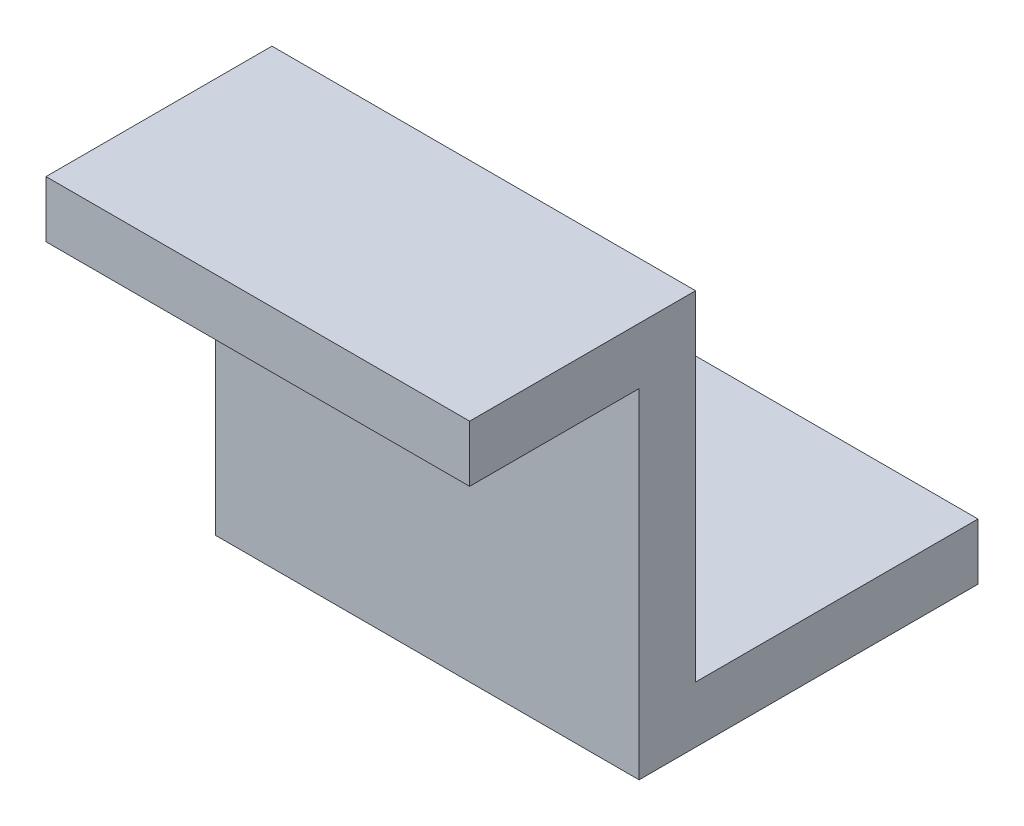
ISO-10303-21;
HEADER;
FILE_DESCRIPTION(('STEP AP214'),'2;1');
FILE_NAME('part.step','',(''),(''),'','','');
FILE_SCHEMA(('AUTOMOTIVE_DESIGN { 1 0 10303 214 1 1 1 1 }'));
ENDSEC;
DATA;
#1=APPLICATION_CONTEXT('core data for automotive mechanical design processes');
#2=APPLICATION_PROTOCOL_DEFINITION('international standard','automotive_design',2000,#1);
#3=PRODUCT_CONTEXT('',#1,'mechanical');
#4=PRODUCT('Part','Part','',(#3));
#5=PRODUCT_RELATED_PRODUCT_CATEGORY('part','',(#4));
#6=PRODUCT_DEFINITION_FORMATION('','',#4);
#7=PRODUCT_DEFINITION_CONTEXT('part definition',#1,'design');
#8=PRODUCT_DEFINITION('design','',#6,#7);
#9=PRODUCT_DEFINITION_SHAPE('','',#8);
#10=(LENGTH_UNIT() NAMED_UNIT(*) SI_UNIT(.MILLI.,.METRE.));
#11=(NAMED_UNIT(*) PLANE_ANGLE_UNIT() SI_UNIT($,.RADIAN.));
#12=(NAMED_UNIT(*) SI_UNIT($,.STERADIAN.) SOLID_ANGLE_UNIT());
#13=UNCERTAINTY_MEASURE_WITH_UNIT(LENGTH_MEASURE(1.E-05),#10,'distance_accuracy_value','');
#14=(GEOMETRIC_REPRESENTATION_CONTEXT(3) GLOBAL_UNCERTAINTY_ASSIGNED_CONTEXT((#13)) GLOBAL_UNIT_ASSIGNED_CONTEXT((#10,
#11,#12)) REPRESENTATION_CONTEXT('',''));
#15=CARTESIAN_POINT('',(0.,0.,0.));
#16=DIRECTION('',(0.,0.,1.));
#17=DIRECTION('',(1.,0.,0.));
#18=AXIS2_PLACEMENT_3D('',#15,#16,#17);
#19=CARTESIAN_POINT('',(-15.,-2.,0.));
#20=DIRECTION('',(0.,0.,1.));
#21=DIRECTION('',(1.,0.,0.));
#22=AXIS2_PLACEMENT_3D('',#19,#20,#21);
#23=PLANE('',#22);
#24=DIRECTION('',(0.,-1.,0.));
#25=VECTOR('',#24,1.);
#26=CARTESIAN_POINT('',(0.,-2.,0.));
#27=LINE('',#26,#25);
#28=CARTESIAN_POINT('',(0.,0.,0.));
#29=VERTEX_POINT('',#28);
#30=CARTESIAN_POINT('',(0.,-2.,0.));
#31=VERTEX_POINT('',#30);
#32=EDGE_CURVE('E130',#29,#31,#27,.T.);
#33=ORIENTED_EDGE('',*,*,#32,.F.);
#34=DIRECTION('',(1.,0.,0.));
#35=VECTOR('',#34,1.);
#36=CARTESIAN_POINT('',(-15.,0.,0.));
#37=LINE('',#36,#35);
#38=CARTESIAN_POINT('',(-15.,0.,0.));
#39=VERTEX_POINT('',#38);
#40=EDGE_CURVE('E11',#39,#29,#37,.T.);
#41=ORIENTED_EDGE('',*,*,#40,.F.);
#42=DIRECTION('',(0.,-1.,0.));
#43=VECTOR('',#42,1.);
#44=CARTESIAN_POINT('',(-15.,-2.,0.));
#45=LINE('',#44,#43);
#46=CARTESIAN_POINT('',(-15.,-2.,0.));
#47=VERTEX_POINT('',#46);
#48=EDGE_CURVE('E151',#39,#47,#45,.T.);
#49=ORIENTED_EDGE('',*,*,#48,.T.);
#50=DIRECTION('',(1.,0.,0.));
#51=VECTOR('',#50,1.);
#52=CARTESIAN_POINT('',(-15.,-2.,0.));
#53=LINE('',#52,#51);
#54=EDGE_CURVE('E36',#47,#31,#53,.T.);
#55=ORIENTED_EDGE('',*,*,#54,.T.);
#56=EDGE_LOOP('',(#33,#41,#49,#55));
#57=FACE_BOUND('',#56,.T.);
#58=ADVANCED_FACE('F33',(#57),#23,.T.);
#59=CARTESIAN_POINT('',(-15.,0.,0.));
#60=DIRECTION('',(0.,1.,0.));
#61=DIRECTION('',(0.,0.,1.));
#62=AXIS2_PLACEMENT_3D('',#59,#60,#61);
#63=PLANE('',#62);
#64=DIRECTION('',(0.,0.,1.));
#65=VECTOR('',#64,1.);
#66=CARTESIAN_POINT('',(0.,0.,0.));
#67=LINE('',#66,#65);
#68=CARTESIAN_POINT('',(0.,0.,-8.));
#69=VERTEX_POINT('',#68);
#70=EDGE_CURVE('E149',#69,#29,#67,.T.);
#71=ORIENTED_EDGE('',*,*,#70,.F.);
#72=DIRECTION('',(1.,0.,0.));
#73=VECTOR('',#72,1.);
#74=CARTESIAN_POINT('',(-15.,0.,-8.));
#75=LINE('',#74,#73);
#76=CARTESIAN_POINT('',(-15.,0.,-8.));
#77=VERTEX_POINT('',#76);
#78=EDGE_CURVE('E42',#77,#69,#75,.T.);
#79=ORIENTED_EDGE('',*,*,#78,.F.);
#80=DIRECTION('',(0.,0.,1.));
#81=VECTOR('',#80,1.);
#82=CARTESIAN_POINT('',(-15.,0.,0.));
#83=LINE('',#82,#81);
#84=EDGE_CURVE('E120',#77,#39,#83,.T.);
#85=ORIENTED_EDGE('',*,*,#84,.T.);
#86=ORIENTED_EDGE('',*,*,#40,.T.);
#87=EDGE_LOOP('',(#71,#79,#85,#86));
#88=FACE_BOUND('',#87,.T.);
#89=ADVANCED_FACE('F163',(#88),#63,.T.);
#90=CARTESIAN_POINT('',(-15.,0.,-8.));
#91=DIRECTION('',(0.,0.,-1.));
#92=DIRECTION('',(0.,1.,0.));
#93=AXIS2_PLACEMENT_3D('',#90,#91,#92);
#94=PLANE('',#93);
#95=DIRECTION('',(0.,1.,0.));
#96=VECTOR('',#95,1.);
#97=CARTESIAN_POINT('',(0.,0.,-8.));
#98=LINE('',#97,#96);
#99=CARTESIAN_POINT('',(0.,-12.,-8.));
#100=VERTEX_POINT('',#99);
#101=EDGE_CURVE('E107',#100,#69,#98,.T.);
#102=ORIENTED_EDGE('',*,*,#101,.F.);
#103=DIRECTION('',(1.,0.,0.));
#104=VECTOR('',#103,1.);
#105=CARTESIAN_POINT('',(-15.,-12.,-8.));
#106=LINE('',#105,#104);
#107=CARTESIAN_POINT('',(-15.,-12.,-8.));
#108=VERTEX_POINT('',#107);
#109=EDGE_CURVE('E102',#108,#100,#106,.T.);
#110=ORIENTED_EDGE('',*,*,#109,.F.);
#111=DIRECTION('',(0.,1.,0.));
#112=VECTOR('',#111,1.);
#113=CARTESIAN_POINT('',(-15.,0.,-8.));
#114=LINE('',#113,#112);
#115=EDGE_CURVE('E105',#108,#77,#114,.T.);
#116=ORIENTED_EDGE('',*,*,#115,.T.);
#117=ORIENTED_EDGE('',*,*,#78,.T.);
#118=EDGE_LOOP('',(#102,#110,#116,#117));
#119=FACE_BOUND('',#118,.T.);
#120=ADVANCED_FACE('F104',(#119),#94,.T.);
#121=CARTESIAN_POINT('',(-15.,-12.,-8.));
#122=DIRECTION('',(0.,1.,0.));
#123=DIRECTION('',(0.,0.,1.));
#124=AXIS2_PLACEMENT_3D('',#121,#122,#123);
#125=PLANE('',#124);
#126=CARTESIAN_POINT('',(-7.5,-12.,-13.));
#127=DIRECTION('',(0.,1.,0.));
#128=DIRECTION('',(0.,0.,1.));
#129=AXIS2_PLACEMENT_3D('',#126,#127,#128);
#130=CIRCLE('',#129,1.5);
#131=CARTESIAN_POINT('',(-7.5,-12.,-11.5));
#132=VERTEX_POINT('',#131);
#133=EDGE_CURVE('E134',#132,#132,#130,.T.);
#134=ORIENTED_EDGE('',*,*,#133,.F.);
#135=EDGE_LOOP('',(#134));
#136=FACE_BOUND('',#135,.T.);
#137=DIRECTION('',(0.,0.,1.));
#138=VECTOR('',#137,1.);
#139=CARTESIAN_POINT('',(0.,-12.,-8.));
#140=LINE('',#139,#138);
#141=CARTESIAN_POINT('',(0.,-12.,-18.));
#142=VERTEX_POINT('',#141);
#143=EDGE_CURVE('E146',#142,#100,#140,.T.);
#144=ORIENTED_EDGE('',*,*,#143,.F.);
#145=DIRECTION('',(1.,0.,0.));
#146=VECTOR('',#145,1.);
#147=CARTESIAN_POINT('',(-15.,-12.,-18.));
#148=LINE('',#147,#146);
#149=CARTESIAN_POINT('',(-15.,-12.,-18.));
#150=VERTEX_POINT('',#149);
#151=EDGE_CURVE('E112',#150,#142,#148,.T.);
#152=ORIENTED_EDGE('',*,*,#151,.F.);
#153=DIRECTION('',(0.,0.,1.));
#154=VECTOR('',#153,1.);
#155=CARTESIAN_POINT('',(-15.,-12.,-8.));
#156=LINE('',#155,#154);
#157=EDGE_CURVE('E118',#150,#108,#156,.T.);
#158=ORIENTED_EDGE('',*,*,#157,.T.);
#159=ORIENTED_EDGE('',*,*,#109,.T.);
#160=EDGE_LOOP('',(#144,#152,#158,#159));
#161=FACE_BOUND('',#160,.T.);
#162=ADVANCED_FACE('F122',(#136,#161),#125,.T.);
#163=CARTESIAN_POINT('',(-15.,-12.,-18.));
#164=DIRECTION('',(0.,0.,-1.));
#165=DIRECTION('',(-1.,0.,0.));
#166=AXIS2_PLACEMENT_3D('',#163,#164,#165);
#167=PLANE('',#166);
#168=DIRECTION('',(0.,1.,0.));
#169=VECTOR('',#168,1.);
#170=CARTESIAN_POINT('',(0.,-12.,-18.));
#171=LINE('',#170,#169);
#172=CARTESIAN_POINT('',(0.,-14.,-18.));
#173=VERTEX_POINT('',#172);
#174=EDGE_CURVE('E143',#173,#142,#171,.T.);
#175=ORIENTED_EDGE('',*,*,#174,.F.);
#176=DIRECTION('',(1.,0.,0.));
#177=VECTOR('',#176,1.);
#178=CARTESIAN_POINT('',(-15.,-14.,-18.));
#179=LINE('',#178,#177);
#180=CARTESIAN_POINT('',(-15.,-14.,-18.));
#181=VERTEX_POINT('',#180);
#182=EDGE_CURVE('E155',#181,#173,#179,.T.);
#183=ORIENTED_EDGE('',*,*,#182,.F.);
#184=DIRECTION('',(0.,1.,0.));
#185=VECTOR('',#184,1.);
#186=CARTESIAN_POINT('',(-15.,-12.,-18.));
#187=LINE('',#186,#185);
#188=EDGE_CURVE('E123',#181,#150,#187,.T.);
#189=ORIENTED_EDGE('',*,*,#188,.T.);
#190=ORIENTED_EDGE('',*,*,#151,.T.);
#191=EDGE_LOOP('',(#175,#183,#189,#190));
#192=FACE_BOUND('',#191,.T.);
#193=ADVANCED_FACE('F176',(#192),#167,.T.);
#194=CARTESIAN_POINT('',(-15.,-14.,-18.));
#195=DIRECTION('',(0.,-1.,0.));
#196=DIRECTION('',(0.,0.,-1.));
#197=AXIS2_PLACEMENT_3D('',#194,#195,#196);
#198=PLANE('',#197);
#199=CARTESIAN_POINT('',(-7.5,-14.,-13.));
#200=DIRECTION('',(0.,-1.,0.));
#201=DIRECTION('',(0.,0.,-1.));
#202=AXIS2_PLACEMENT_3D('',#199,#200,#201);
#203=CIRCLE('',#202,1.5);
#204=CARTESIAN_POINT('',(-7.5,-14.,-14.5));
#205=VERTEX_POINT('',#204);
#206=EDGE_CURVE('E204',#205,#205,#203,.F.);
#207=ORIENTED_EDGE('',*,*,#206,.T.);
#208=EDGE_LOOP('',(#207));
#209=FACE_BOUND('',#208,.T.);
#210=DIRECTION('',(0.,0.,-1.));
#211=VECTOR('',#210,1.);
#212=CARTESIAN_POINT('',(0.,-14.,-18.));
#213=LINE('',#212,#211);
#214=CARTESIAN_POINT('',(0.,-14.,-6.));
#215=VERTEX_POINT('',#214);
#216=EDGE_CURVE('E140',#215,#173,#213,.T.);
#217=ORIENTED_EDGE('',*,*,#216,.F.);
#218=DIRECTION('',(1.,0.,0.));
#219=VECTOR('',#218,1.);
#220=CARTESIAN_POINT('',(-15.,-14.,-6.));
#221=LINE('',#220,#219);
#222=CARTESIAN_POINT('',(-15.,-14.,-6.));
#223=VERTEX_POINT('',#222);
#224=EDGE_CURVE('E157',#223,#215,#221,.T.);
#225=ORIENTED_EDGE('',*,*,#224,.F.);
#226=DIRECTION('',(0.,0.,-1.));
#227=VECTOR('',#226,1.);
#228=CARTESIAN_POINT('',(-15.,-14.,-18.));
#229=LINE('',#228,#227);
#230=EDGE_CURVE('E125',#223,#181,#229,.T.);
#231=ORIENTED_EDGE('',*,*,#230,.T.);
#232=ORIENTED_EDGE('',*,*,#182,.T.);
#233=EDGE_LOOP('',(#217,#225,#231,#232));
#234=FACE_BOUND('',#233,.T.);
#235=ADVANCED_FACE('F180',(#209,#234),#198,.T.);
#236=CARTESIAN_POINT('',(-15.,-14.,-6.));
#237=DIRECTION('',(0.,0.,1.));
#238=DIRECTION('',(1.,0.,0.));
#239=AXIS2_PLACEMENT_3D('',#236,#237,#238);
#240=PLANE('',#239);
#241=DIRECTION('',(0.,-1.,0.));
#242=VECTOR('',#241,1.);
#243=CARTESIAN_POINT('',(0.,-14.,-6.));
#244=LINE('',#243,#242);
#245=CARTESIAN_POINT('',(0.,-2.,-6.));
#246=VERTEX_POINT('',#245);
#247=EDGE_CURVE('E137',#246,#215,#244,.T.);
#248=ORIENTED_EDGE('',*,*,#247,.F.);
#249=DIRECTION('',(1.,0.,0.));
#250=VECTOR('',#249,1.);
#251=CARTESIAN_POINT('',(-15.,-2.,-6.));
#252=LINE('',#251,#250);
#253=CARTESIAN_POINT('',(-15.,-2.,-6.));
#254=VERTEX_POINT('',#253);
#255=EDGE_CURVE('E158',#254,#246,#252,.T.);
#256=ORIENTED_EDGE('',*,*,#255,.F.);
#257=DIRECTION('',(0.,-1.,0.));
#258=VECTOR('',#257,1.);
#259=CARTESIAN_POINT('',(-15.,-14.,-6.));
#260=LINE('',#259,#258);
#261=EDGE_CURVE('E213',#254,#223,#260,.T.);
#262=ORIENTED_EDGE('',*,*,#261,.T.);
#263=ORIENTED_EDGE('',*,*,#224,.T.);
#264=EDGE_LOOP('',(#248,#256,#262,#263));
#265=FACE_BOUND('',#264,.T.);
#266=ADVANCED_FACE('F184',(#265),#240,.T.);
#267=CARTESIAN_POINT('',(-15.,-2.,-6.));
#268=DIRECTION('',(0.,-1.,0.));
#269=DIRECTION('',(0.,0.,-1.));
#270=AXIS2_PLACEMENT_3D('',#267,#268,#269);
#271=PLANE('',#270);
#272=DIRECTION('',(0.,0.,-1.));
#273=VECTOR('',#272,1.);
#274=CARTESIAN_POINT('',(0.,-2.,-6.));
#275=LINE('',#274,#273);
#276=EDGE_CURVE('E133',#31,#246,#275,.T.);
#277=ORIENTED_EDGE('',*,*,#276,.F.);
#278=ORIENTED_EDGE('',*,*,#54,.F.);
#279=DIRECTION('',(0.,0.,-1.));
#280=VECTOR('',#279,1.);
#281=CARTESIAN_POINT('',(-15.,-2.,-6.));
#282=LINE('',#281,#280);
#283=EDGE_CURVE('E211',#47,#254,#282,.T.);
#284=ORIENTED_EDGE('',*,*,#283,.T.);
#285=ORIENTED_EDGE('',*,*,#255,.T.);
#286=EDGE_LOOP('',(#277,#278,#284,#285));
#287=FACE_BOUND('',#286,.T.);
#288=ADVANCED_FACE('F160',(#287),#271,.T.);
#289=CARTESIAN_POINT('',(-15.,0.,0.));
#290=DIRECTION('',(-1.,0.,0.));
#291=DIRECTION('',(0.,0.,1.));
#292=AXIS2_PLACEMENT_3D('',#289,#290,#291);
#293=PLANE('',#292);
#294=ORIENTED_EDGE('',*,*,#48,.F.);
#295=ORIENTED_EDGE('',*,*,#84,.F.);
#296=ORIENTED_EDGE('',*,*,#115,.F.);
#297=ORIENTED_EDGE('',*,*,#157,.F.);
#298=ORIENTED_EDGE('',*,*,#188,.F.);
#299=ORIENTED_EDGE('',*,*,#230,.F.);
#300=ORIENTED_EDGE('',*,*,#261,.F.);
#301=ORIENTED_EDGE('',*,*,#283,.F.);
#302=EDGE_LOOP('',(#294,#295,#296,#297,#298,#299,#300,#301));
#303=FACE_BOUND('',#302,.T.);
#304=ADVANCED_FACE('F116',(#303),#293,.T.);
#305=CARTESIAN_POINT('',(0.,0.,0.));
#306=DIRECTION('',(-1.,0.,0.));
#307=DIRECTION('',(0.,0.,1.));
#308=AXIS2_PLACEMENT_3D('',#305,#306,#307);
#309=PLANE('',#308);
#310=ORIENTED_EDGE('',*,*,#32,.T.);
#311=ORIENTED_EDGE('',*,*,#276,.T.);
#312=ORIENTED_EDGE('',*,*,#247,.T.);
#313=ORIENTED_EDGE('',*,*,#216,.T.);
#314=ORIENTED_EDGE('',*,*,#174,.T.);
#315=ORIENTED_EDGE('',*,*,#143,.T.);
#316=ORIENTED_EDGE('',*,*,#101,.T.);
#317=ORIENTED_EDGE('',*,*,#70,.T.);
#318=EDGE_LOOP('',(#310,#311,#312,#313,#314,#315,#316,#317));
#319=FACE_BOUND('',#318,.T.);
#320=ADVANCED_FACE('F162',(#319),#309,.F.);
#321=CARTESIAN_POINT('',(-7.5,-14.001,-13.));
#322=DIRECTION('',(0.,1.,0.));
#323=DIRECTION('',(0.,0.,1.));
#324=AXIS2_PLACEMENT_3D('',#321,#322,#323);
#325=CYLINDRICAL_SURFACE('',#324,1.5);
#326=ORIENTED_EDGE('',*,*,#206,.F.);
#327=EDGE_LOOP('',(#326));
#328=FACE_BOUND('',#327,.T.);
#329=ORIENTED_EDGE('',*,*,#133,.T.);
#330=EDGE_LOOP('',(#329));
#331=FACE_BOUND('',#330,.T.);
#332=ADVANCED_FACE('F195',(#328,#331),#325,.F.);
#333=CLOSED_SHELL('',(#58,#89,#120,#162,#193,#235,#266,#288,#304,#320,#332));
#334=MANIFOLD_SOLID_BREP('B2',#333);
#335=ADVANCED_BREP_SHAPE_REPRESENTATION('',(#18,#334),#14);
#336=SHAPE_DEFINITION_REPRESENTATION(#9,#335);
ENDSEC;
END-ISO-10303-21;
